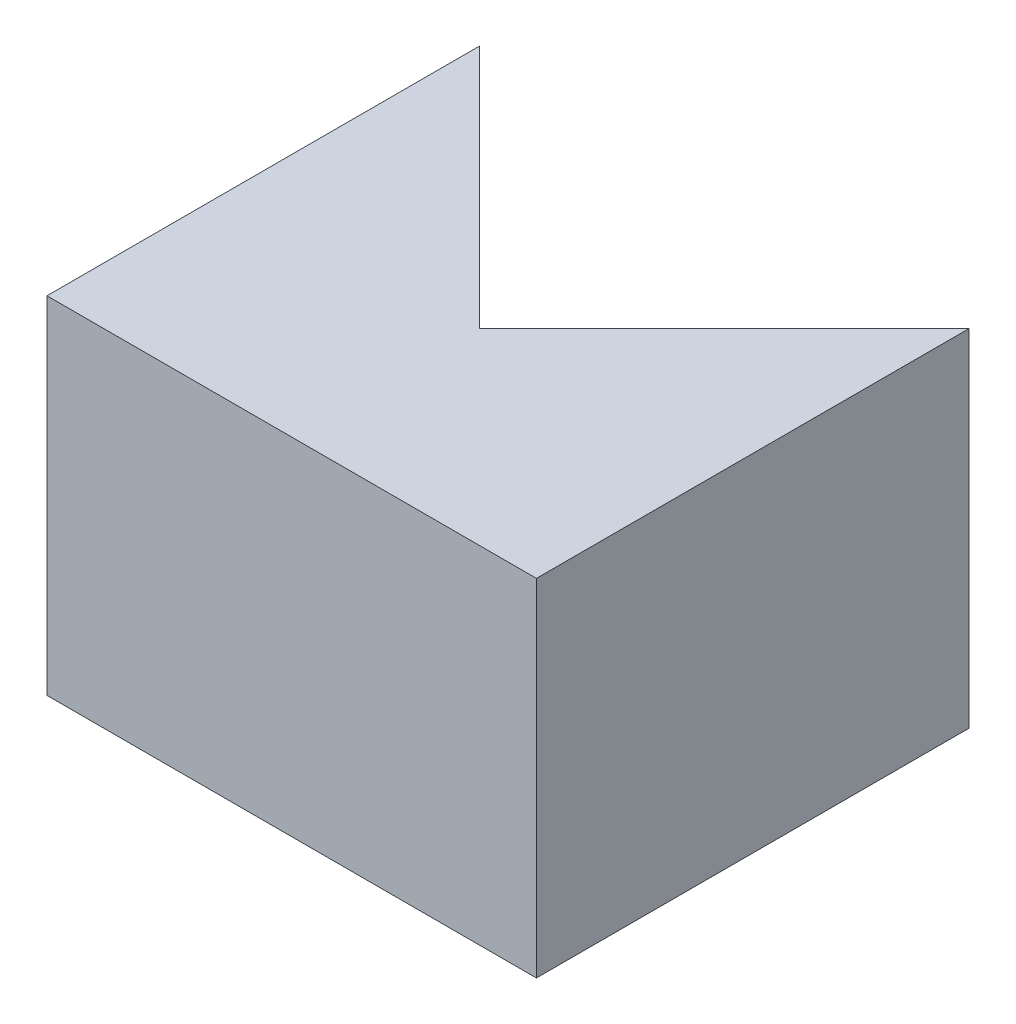
ISO-10303-21;
HEADER;
FILE_DESCRIPTION(('STEP AP214'),'2;1');
FILE_NAME('part.step','',(''),(''),'','','');
FILE_SCHEMA(('AUTOMOTIVE_DESIGN { 1 0 10303 214 1 1 1 1 }'));
ENDSEC;
DATA;
#1=APPLICATION_CONTEXT('core data for automotive mechanical design processes');
#2=APPLICATION_PROTOCOL_DEFINITION('international standard','automotive_design',2000,#1);
#3=PRODUCT_CONTEXT('',#1,'mechanical');
#4=PRODUCT('Part','Part','',(#3));
#5=PRODUCT_RELATED_PRODUCT_CATEGORY('part','',(#4));
#6=PRODUCT_DEFINITION_FORMATION('','',#4);
#7=PRODUCT_DEFINITION_CONTEXT('part definition',#1,'design');
#8=PRODUCT_DEFINITION('design','',#6,#7);
#9=PRODUCT_DEFINITION_SHAPE('','',#8);
#10=(LENGTH_UNIT() NAMED_UNIT(*) SI_UNIT(.MILLI.,.METRE.));
#11=(NAMED_UNIT(*) PLANE_ANGLE_UNIT() SI_UNIT($,.RADIAN.));
#12=(NAMED_UNIT(*) SI_UNIT($,.STERADIAN.) SOLID_ANGLE_UNIT());
#13=UNCERTAINTY_MEASURE_WITH_UNIT(LENGTH_MEASURE(1.E-05),#10,'distance_accuracy_value','');
#14=(GEOMETRIC_REPRESENTATION_CONTEXT(3) GLOBAL_UNCERTAINTY_ASSIGNED_CONTEXT((#13)) GLOBAL_UNIT_ASSIGNED_CONTEXT((#10,
#11,#12)) REPRESENTATION_CONTEXT('',''));
#15=CARTESIAN_POINT('',(0.,0.,0.));
#16=DIRECTION('',(0.,0.,1.));
#17=DIRECTION('',(1.,0.,0.));
#18=AXIS2_PLACEMENT_3D('',#15,#16,#17);
#19=CARTESIAN_POINT('',(-17.9605122421384,50.8,-17.9605122421382));
#20=DIRECTION('',(1.,0.,0.));
#21=DIRECTION('',(0.,0.,-1.));
#22=AXIS2_PLACEMENT_3D('',#19,#20,#21);
#23=PLANE('',#22);
#24=DIRECTION('',(0.,0.,1.));
#25=VECTOR('',#24,1.);
#26=CARTESIAN_POINT('',(-17.9605122421384,0.,-17.9605122421382));
#27=LINE('',#26,#25);
#28=CARTESIAN_POINT('',(-17.9605122421384,0.,-17.9605122421382));
#29=VERTEX_POINT('',#28);
#30=CARTESIAN_POINT('',(-17.9605122421384,0.,45.5394877578618));
#31=VERTEX_POINT('',#30);
#32=EDGE_CURVE('E193',#29,#31,#27,.T.);
#33=ORIENTED_EDGE('',*,*,#32,.T.);
#34=DIRECTION('',(0.,-1.,0.));
#35=VECTOR('',#34,1.);
#36=CARTESIAN_POINT('',(-17.9605122421384,50.8,45.5394877578618));
#37=LINE('',#36,#35);
#38=CARTESIAN_POINT('',(-17.9605122421384,50.8,45.5394877578618));
#39=VERTEX_POINT('',#38);
#40=EDGE_CURVE('E12',#39,#31,#37,.T.);
#41=ORIENTED_EDGE('',*,*,#40,.F.);
#42=DIRECTION('',(0.,0.,1.));
#43=VECTOR('',#42,1.);
#44=CARTESIAN_POINT('',(-17.9605122421384,50.8,-17.9605122421382));
#45=LINE('',#44,#43);
#46=CARTESIAN_POINT('',(-17.9605122421384,50.8,-17.9605122421382));
#47=VERTEX_POINT('',#46);
#48=EDGE_CURVE('E176',#47,#39,#45,.T.);
#49=ORIENTED_EDGE('',*,*,#48,.F.);
#50=DIRECTION('',(0.,-1.,0.));
#51=VECTOR('',#50,1.);
#52=CARTESIAN_POINT('',(-17.9605122421384,50.8,-17.9605122421382));
#53=LINE('',#52,#51);
#54=EDGE_CURVE('E131',#47,#29,#53,.T.);
#55=ORIENTED_EDGE('',*,*,#54,.T.);
#56=EDGE_LOOP('',(#33,#41,#49,#55));
#57=FACE_BOUND('',#56,.T.);
#58=ADVANCED_FACE('F45',(#57),#23,.F.);
#59=CARTESIAN_POINT('',(-17.9605122421384,50.8,45.5394877578618));
#60=DIRECTION('',(0.,0.,-1.));
#61=DIRECTION('',(-1.,0.,0.));
#62=AXIS2_PLACEMENT_3D('',#59,#60,#61);
#63=PLANE('',#62);
#64=DIRECTION('',(1.,0.,0.));
#65=VECTOR('',#64,1.);
#66=CARTESIAN_POINT('',(-17.9605122421384,0.,45.5394877578618));
#67=LINE('',#66,#65);
#68=CARTESIAN_POINT('',(53.881536726415,0.,45.5394877578618));
#69=VERTEX_POINT('',#68);
#70=EDGE_CURVE('E163',#31,#69,#67,.T.);
#71=ORIENTED_EDGE('',*,*,#70,.T.);
#72=DIRECTION('',(0.,-1.,0.));
#73=VECTOR('',#72,1.);
#74=CARTESIAN_POINT('',(53.881536726415,50.8,45.5394877578618));
#75=LINE('',#74,#73);
#76=CARTESIAN_POINT('',(53.881536726415,50.8,45.5394877578618));
#77=VERTEX_POINT('',#76);
#78=EDGE_CURVE('E56',#77,#69,#75,.T.);
#79=ORIENTED_EDGE('',*,*,#78,.F.);
#80=DIRECTION('',(1.,0.,0.));
#81=VECTOR('',#80,1.);
#82=CARTESIAN_POINT('',(-17.9605122421384,50.8,45.5394877578618));
#83=LINE('',#82,#81);
#84=EDGE_CURVE('E107',#39,#77,#83,.T.);
#85=ORIENTED_EDGE('',*,*,#84,.F.);
#86=ORIENTED_EDGE('',*,*,#40,.T.);
#87=EDGE_LOOP('',(#71,#79,#85,#86));
#88=FACE_BOUND('',#87,.T.);
#89=ADVANCED_FACE('F205',(#88),#63,.F.);
#90=CARTESIAN_POINT('',(53.881536726415,50.8,-17.9605122421385));
#91=DIRECTION('',(-1.,0.,0.));
#92=DIRECTION('',(0.,0.,1.));
#93=AXIS2_PLACEMENT_3D('',#90,#91,#92);
#94=PLANE('',#93);
#95=DIRECTION('',(0.,0.,-1.));
#96=VECTOR('',#95,1.);
#97=CARTESIAN_POINT('',(53.881536726415,0.,-17.9605122421385));
#98=LINE('',#97,#96);
#99=CARTESIAN_POINT('',(53.881536726415,0.,-17.9605122421385));
#100=VERTEX_POINT('',#99);
#101=EDGE_CURVE('E124',#69,#100,#98,.T.);
#102=ORIENTED_EDGE('',*,*,#101,.T.);
#103=DIRECTION('',(0.,-1.,0.));
#104=VECTOR('',#103,1.);
#105=CARTESIAN_POINT('',(53.881536726415,50.8,-17.9605122421385));
#106=LINE('',#105,#104);
#107=CARTESIAN_POINT('',(53.881536726415,50.8,-17.9605122421385));
#108=VERTEX_POINT('',#107);
#109=EDGE_CURVE('E121',#108,#100,#106,.T.);
#110=ORIENTED_EDGE('',*,*,#109,.F.);
#111=DIRECTION('',(0.,0.,-1.));
#112=VECTOR('',#111,1.);
#113=CARTESIAN_POINT('',(53.881536726415,50.8,-17.9605122421385));
#114=LINE('',#113,#112);
#115=EDGE_CURVE('E112',#77,#108,#114,.T.);
#116=ORIENTED_EDGE('',*,*,#115,.F.);
#117=ORIENTED_EDGE('',*,*,#78,.T.);
#118=EDGE_LOOP('',(#102,#110,#116,#117));
#119=FACE_BOUND('',#118,.T.);
#120=ADVANCED_FACE('F122',(#119),#94,.F.);
#121=CARTESIAN_POINT('',(17.9605122421384,50.8,17.9605122421382));
#122=DIRECTION('',(0.707106781186549,0.,0.707106781186546));
#123=DIRECTION('',(0.707106781186546,0.,-0.707106781186549));
#124=AXIS2_PLACEMENT_3D('',#121,#122,#123);
#125=PLANE('',#124);
#126=DIRECTION('',(-0.707106781186546,0.,0.707106781186549));
#127=VECTOR('',#126,1.);
#128=CARTESIAN_POINT('',(17.9605122421384,0.,17.9605122421382));
#129=LINE('',#128,#127);
#130=CARTESIAN_POINT('',(17.9605122421384,0.,17.9605122421382));
#131=VERTEX_POINT('',#130);
#132=EDGE_CURVE('E92',#100,#131,#129,.T.);
#133=ORIENTED_EDGE('',*,*,#132,.T.);
#134=DIRECTION('',(0.,-1.,0.));
#135=VECTOR('',#134,1.);
#136=CARTESIAN_POINT('',(17.9605122421384,50.8,17.9605122421382));
#137=LINE('',#136,#135);
#138=CARTESIAN_POINT('',(17.9605122421384,50.8,17.9605122421382));
#139=VERTEX_POINT('',#138);
#140=EDGE_CURVE('E126',#139,#131,#137,.T.);
#141=ORIENTED_EDGE('',*,*,#140,.F.);
#142=DIRECTION('',(-0.707106781186546,0.,0.707106781186549));
#143=VECTOR('',#142,1.);
#144=CARTESIAN_POINT('',(17.9605122421384,50.8,17.9605122421382));
#145=LINE('',#144,#143);
#146=EDGE_CURVE('E116',#108,#139,#145,.T.);
#147=ORIENTED_EDGE('',*,*,#146,.F.);
#148=ORIENTED_EDGE('',*,*,#109,.T.);
#149=EDGE_LOOP('',(#133,#141,#147,#148));
#150=FACE_BOUND('',#149,.T.);
#151=ADVANCED_FACE('F128',(#150),#125,.F.);
#152=CARTESIAN_POINT('',(17.9605122421384,50.8,17.9605122421382));
#153=DIRECTION('',(-0.707106781186544,0.,0.707106781186551));
#154=DIRECTION('',(0.707106781186551,0.,0.707106781186544));
#155=AXIS2_PLACEMENT_3D('',#152,#153,#154);
#156=PLANE('',#155);
#157=DIRECTION('',(-0.707106781186551,0.,-0.707106781186544));
#158=VECTOR('',#157,1.);
#159=CARTESIAN_POINT('',(17.9605122421384,0.,17.9605122421382));
#160=LINE('',#159,#158);
#161=EDGE_CURVE('E99',#131,#29,#160,.T.);
#162=ORIENTED_EDGE('',*,*,#161,.T.);
#163=ORIENTED_EDGE('',*,*,#54,.F.);
#164=DIRECTION('',(-0.707106781186551,0.,-0.707106781186544));
#165=VECTOR('',#164,1.);
#166=CARTESIAN_POINT('',(17.9605122421384,50.8,17.9605122421382));
#167=LINE('',#166,#165);
#168=EDGE_CURVE('E67',#139,#47,#167,.T.);
#169=ORIENTED_EDGE('',*,*,#168,.F.);
#170=ORIENTED_EDGE('',*,*,#140,.T.);
#171=EDGE_LOOP('',(#162,#163,#169,#170));
#172=FACE_BOUND('',#171,.T.);
#173=ADVANCED_FACE('F228',(#172),#156,.F.);
#174=CARTESIAN_POINT('',(0.,50.8,0.));
#175=DIRECTION('',(0.,1.,0.));
#176=DIRECTION('',(0.,0.,1.));
#177=AXIS2_PLACEMENT_3D('',#174,#175,#176);
#178=PLANE('',#177);
#179=ORIENTED_EDGE('',*,*,#48,.T.);
#180=ORIENTED_EDGE('',*,*,#84,.T.);
#181=ORIENTED_EDGE('',*,*,#115,.T.);
#182=ORIENTED_EDGE('',*,*,#146,.T.);
#183=ORIENTED_EDGE('',*,*,#168,.T.);
#184=EDGE_LOOP('',(#179,#180,#181,#182,#183));
#185=FACE_BOUND('',#184,.T.);
#186=ADVANCED_FACE('F114',(#185),#178,.T.);
#187=CARTESIAN_POINT('',(0.,0.,0.));
#188=DIRECTION('',(0.,1.,0.));
#189=DIRECTION('',(0.,0.,1.));
#190=AXIS2_PLACEMENT_3D('',#187,#188,#189);
#191=PLANE('',#190);
#192=ORIENTED_EDGE('',*,*,#32,.F.);
#193=ORIENTED_EDGE('',*,*,#161,.F.);
#194=ORIENTED_EDGE('',*,*,#132,.F.);
#195=ORIENTED_EDGE('',*,*,#101,.F.);
#196=ORIENTED_EDGE('',*,*,#70,.F.);
#197=EDGE_LOOP('',(#192,#193,#194,#195,#196));
#198=FACE_BOUND('',#197,.T.);
#199=ADVANCED_FACE('F207',(#198),#191,.F.);
#200=CLOSED_SHELL('',(#58,#89,#120,#151,#173,#186,#199));
#201=MANIFOLD_SOLID_BREP('B2',#200);
#202=ADVANCED_BREP_SHAPE_REPRESENTATION('',(#18,#201),#14);
#203=SHAPE_DEFINITION_REPRESENTATION(#9,#202);
ENDSEC;
END-ISO-10303-21;
